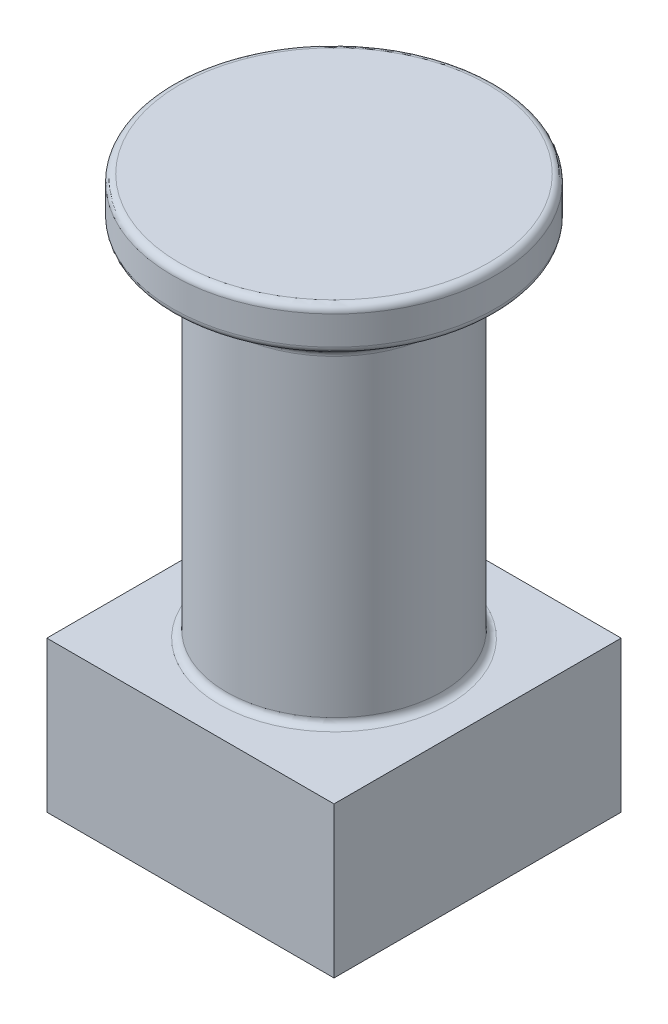
ISO-10303-21;
HEADER;
FILE_DESCRIPTION(('STEP AP214'),'2;1');
FILE_NAME('part.step','',(''),(''),'','','');
FILE_SCHEMA(('AUTOMOTIVE_DESIGN { 1 0 10303 214 1 1 1 1 }'));
ENDSEC;
DATA;
#1=APPLICATION_CONTEXT('core data for automotive mechanical design processes');
#2=APPLICATION_PROTOCOL_DEFINITION('international standard','automotive_design',2000,#1);
#3=PRODUCT_CONTEXT('',#1,'mechanical');
#4=PRODUCT('Part','Part','',(#3));
#5=PRODUCT_RELATED_PRODUCT_CATEGORY('part','',(#4));
#6=PRODUCT_DEFINITION_FORMATION('','',#4);
#7=PRODUCT_DEFINITION_CONTEXT('part definition',#1,'design');
#8=PRODUCT_DEFINITION('design','',#6,#7);
#9=PRODUCT_DEFINITION_SHAPE('','',#8);
#10=(LENGTH_UNIT() NAMED_UNIT(*) SI_UNIT(.MILLI.,.METRE.));
#11=(NAMED_UNIT(*) PLANE_ANGLE_UNIT() SI_UNIT($,.RADIAN.));
#12=(NAMED_UNIT(*) SI_UNIT($,.STERADIAN.) SOLID_ANGLE_UNIT());
#13=UNCERTAINTY_MEASURE_WITH_UNIT(LENGTH_MEASURE(1.E-05),#10,'distance_accuracy_value','');
#14=(GEOMETRIC_REPRESENTATION_CONTEXT(3) GLOBAL_UNCERTAINTY_ASSIGNED_CONTEXT((#13)) GLOBAL_UNIT_ASSIGNED_CONTEXT((#10,
#11,#12)) REPRESENTATION_CONTEXT('',''));
#15=CARTESIAN_POINT('',(0.,0.,0.));
#16=DIRECTION('',(0.,0.,1.));
#17=DIRECTION('',(1.,0.,0.));
#18=AXIS2_PLACEMENT_3D('',#15,#16,#17);
#19=CARTESIAN_POINT('',(20.,21.,-20.));
#20=DIRECTION('',(-1.,0.,0.));
#21=DIRECTION('',(0.,0.,1.));
#22=AXIS2_PLACEMENT_3D('',#19,#20,#21);
#23=PLANE('',#22);
#24=DIRECTION('',(0.,0.,-1.));
#25=VECTOR('',#24,1.);
#26=CARTESIAN_POINT('',(20.,0.,-20.));
#27=LINE('',#26,#25);
#28=CARTESIAN_POINT('',(20.,0.,20.));
#29=VERTEX_POINT('',#28);
#30=CARTESIAN_POINT('',(20.,0.,-20.));
#31=VERTEX_POINT('',#30);
#32=EDGE_CURVE('E103',#29,#31,#27,.T.);
#33=ORIENTED_EDGE('',*,*,#32,.T.);
#34=DIRECTION('',(0.,-1.,0.));
#35=VECTOR('',#34,1.);
#36=CARTESIAN_POINT('',(20.,21.,-20.));
#37=LINE('',#36,#35);
#38=CARTESIAN_POINT('',(20.,21.,-20.));
#39=VERTEX_POINT('',#38);
#40=EDGE_CURVE('E94',#39,#31,#37,.T.);
#41=ORIENTED_EDGE('',*,*,#40,.F.);
#42=DIRECTION('',(0.,0.,-1.));
#43=VECTOR('',#42,1.);
#44=CARTESIAN_POINT('',(20.,21.,-20.));
#45=LINE('',#44,#43);
#46=CARTESIAN_POINT('',(20.,21.,20.));
#47=VERTEX_POINT('',#46);
#48=EDGE_CURVE('E88',#47,#39,#45,.T.);
#49=ORIENTED_EDGE('',*,*,#48,.F.);
#50=DIRECTION('',(0.,-1.,0.));
#51=VECTOR('',#50,1.);
#52=CARTESIAN_POINT('',(20.,21.,20.));
#53=LINE('',#52,#51);
#54=EDGE_CURVE('E99',#47,#29,#53,.T.);
#55=ORIENTED_EDGE('',*,*,#54,.T.);
#56=EDGE_LOOP('',(#33,#41,#49,#55));
#57=FACE_BOUND('',#56,.T.);
#58=ADVANCED_FACE('F35',(#57),#23,.F.);
#59=CARTESIAN_POINT('',(-20.,21.,-20.));
#60=DIRECTION('',(0.,0.,1.));
#61=DIRECTION('',(1.,0.,0.));
#62=AXIS2_PLACEMENT_3D('',#59,#60,#61);
#63=PLANE('',#62);
#64=DIRECTION('',(-1.,0.,0.));
#65=VECTOR('',#64,1.);
#66=CARTESIAN_POINT('',(-20.,0.,-20.));
#67=LINE('',#66,#65);
#68=CARTESIAN_POINT('',(-20.,0.,-20.));
#69=VERTEX_POINT('',#68);
#70=EDGE_CURVE('E93',#31,#69,#67,.T.);
#71=ORIENTED_EDGE('',*,*,#70,.T.);
#72=DIRECTION('',(0.,-1.,0.));
#73=VECTOR('',#72,1.);
#74=CARTESIAN_POINT('',(-20.,21.,-20.));
#75=LINE('',#74,#73);
#76=CARTESIAN_POINT('',(-20.,21.,-20.));
#77=VERTEX_POINT('',#76);
#78=EDGE_CURVE('E91',#77,#69,#75,.T.);
#79=ORIENTED_EDGE('',*,*,#78,.F.);
#80=DIRECTION('',(-1.,0.,0.));
#81=VECTOR('',#80,1.);
#82=CARTESIAN_POINT('',(-20.,21.,-20.));
#83=LINE('',#82,#81);
#84=EDGE_CURVE('E83',#39,#77,#83,.T.);
#85=ORIENTED_EDGE('',*,*,#84,.F.);
#86=ORIENTED_EDGE('',*,*,#40,.T.);
#87=EDGE_LOOP('',(#71,#79,#85,#86));
#88=FACE_BOUND('',#87,.T.);
#89=ADVANCED_FACE('F92',(#88),#63,.F.);
#90=CARTESIAN_POINT('',(-20.,21.,-20.));
#91=DIRECTION('',(1.,0.,0.));
#92=DIRECTION('',(0.,0.,-1.));
#93=AXIS2_PLACEMENT_3D('',#90,#91,#92);
#94=PLANE('',#93);
#95=DIRECTION('',(0.,0.,1.));
#96=VECTOR('',#95,1.);
#97=CARTESIAN_POINT('',(-20.,0.,-20.));
#98=LINE('',#97,#96);
#99=CARTESIAN_POINT('',(-20.,0.,20.));
#100=VERTEX_POINT('',#99);
#101=EDGE_CURVE('E69',#69,#100,#98,.T.);
#102=ORIENTED_EDGE('',*,*,#101,.T.);
#103=DIRECTION('',(0.,-1.,0.));
#104=VECTOR('',#103,1.);
#105=CARTESIAN_POINT('',(-20.,21.,20.));
#106=LINE('',#105,#104);
#107=CARTESIAN_POINT('',(-20.,21.,20.));
#108=VERTEX_POINT('',#107);
#109=EDGE_CURVE('E95',#108,#100,#106,.T.);
#110=ORIENTED_EDGE('',*,*,#109,.F.);
#111=DIRECTION('',(0.,0.,1.));
#112=VECTOR('',#111,1.);
#113=CARTESIAN_POINT('',(-20.,21.,-20.));
#114=LINE('',#113,#112);
#115=EDGE_CURVE('E86',#77,#108,#114,.T.);
#116=ORIENTED_EDGE('',*,*,#115,.F.);
#117=ORIENTED_EDGE('',*,*,#78,.T.);
#118=EDGE_LOOP('',(#102,#110,#116,#117));
#119=FACE_BOUND('',#118,.T.);
#120=ADVANCED_FACE('F97',(#119),#94,.F.);
#121=CARTESIAN_POINT('',(-20.,21.,20.));
#122=DIRECTION('',(0.,0.,-1.));
#123=DIRECTION('',(-1.,0.,0.));
#124=AXIS2_PLACEMENT_3D('',#121,#122,#123);
#125=PLANE('',#124);
#126=DIRECTION('',(1.,0.,0.));
#127=VECTOR('',#126,1.);
#128=CARTESIAN_POINT('',(-20.,0.,20.));
#129=LINE('',#128,#127);
#130=EDGE_CURVE('E75',#100,#29,#129,.T.);
#131=ORIENTED_EDGE('',*,*,#130,.T.);
#132=ORIENTED_EDGE('',*,*,#54,.F.);
#133=DIRECTION('',(1.,0.,0.));
#134=VECTOR('',#133,1.);
#135=CARTESIAN_POINT('',(-20.,21.,20.));
#136=LINE('',#135,#134);
#137=EDGE_CURVE('E52',#108,#47,#136,.T.);
#138=ORIENTED_EDGE('',*,*,#137,.F.);
#139=ORIENTED_EDGE('',*,*,#109,.T.);
#140=EDGE_LOOP('',(#131,#132,#138,#139));
#141=FACE_BOUND('',#140,.T.);
#142=ADVANCED_FACE('F198',(#141),#125,.F.);
#143=CARTESIAN_POINT('',(0.,21.,0.));
#144=DIRECTION('',(0.,1.,0.));
#145=DIRECTION('',(0.,0.,1.));
#146=AXIS2_PLACEMENT_3D('',#143,#144,#145);
#147=PLANE('',#146);
#148=CARTESIAN_POINT('',(0.,21.,0.));
#149=DIRECTION('',(0.,1.,0.));
#150=DIRECTION('',(0.,0.,1.));
#151=AXIS2_PLACEMENT_3D('',#148,#149,#150);
#152=CIRCLE('',#151,16.);
#153=CARTESIAN_POINT('',(0.,21.,16.));
#154=VERTEX_POINT('',#153);
#155=EDGE_CURVE('E11',#154,#154,#152,.F.);
#156=ORIENTED_EDGE('',*,*,#155,.T.);
#157=EDGE_LOOP('',(#156));
#158=FACE_BOUND('',#157,.T.);
#159=ORIENTED_EDGE('',*,*,#48,.T.);
#160=ORIENTED_EDGE('',*,*,#84,.T.);
#161=ORIENTED_EDGE('',*,*,#115,.T.);
#162=ORIENTED_EDGE('',*,*,#137,.T.);
#163=EDGE_LOOP('',(#159,#160,#161,#162));
#164=FACE_BOUND('',#163,.T.);
#165=ADVANCED_FACE('F84',(#158,#164),#147,.T.);
#166=CARTESIAN_POINT('',(0.,0.,0.));
#167=DIRECTION('',(0.,1.,0.));
#168=DIRECTION('',(0.,0.,1.));
#169=AXIS2_PLACEMENT_3D('',#166,#167,#168);
#170=PLANE('',#169);
#171=ORIENTED_EDGE('',*,*,#32,.F.);
#172=ORIENTED_EDGE('',*,*,#130,.F.);
#173=ORIENTED_EDGE('',*,*,#101,.F.);
#174=ORIENTED_EDGE('',*,*,#70,.F.);
#175=EDGE_LOOP('',(#171,#172,#173,#174));
#176=FACE_BOUND('',#175,.T.);
#177=ADVANCED_FACE('F195',(#176),#170,.F.);
#178=CARTESIAN_POINT('',(0.,71.,0.));
#179=DIRECTION('',(0.,-1.,0.));
#180=DIRECTION('',(0.,0.,-1.));
#181=AXIS2_PLACEMENT_3D('',#178,#179,#180);
#182=CYLINDRICAL_SURFACE('',#181,15.);
#183=CARTESIAN_POINT('',(0.,65.5857864376269,0.));
#184=DIRECTION('',(0.,-1.,0.));
#185=DIRECTION('',(0.,0.,-1.));
#186=AXIS2_PLACEMENT_3D('',#183,#184,#185);
#187=CIRCLE('',#186,15.);
#188=CARTESIAN_POINT('',(0.,65.5857864376269,-15.));
#189=VERTEX_POINT('',#188);
#190=EDGE_CURVE('E44',#189,#189,#187,.T.);
#191=ORIENTED_EDGE('',*,*,#190,.T.);
#192=EDGE_LOOP('',(#191));
#193=FACE_BOUND('',#192,.T.);
#194=CARTESIAN_POINT('',(0.,22.,0.));
#195=DIRECTION('',(0.,1.,0.));
#196=DIRECTION('',(0.,0.,1.));
#197=AXIS2_PLACEMENT_3D('',#194,#195,#196);
#198=CIRCLE('',#197,15.);
#199=CARTESIAN_POINT('',(0.,22.,15.));
#200=VERTEX_POINT('',#199);
#201=EDGE_CURVE('E133',#200,#200,#198,.T.);
#202=ORIENTED_EDGE('',*,*,#201,.T.);
#203=EDGE_LOOP('',(#202));
#204=FACE_BOUND('',#203,.T.);
#205=ADVANCED_FACE('F138',(#193,#204),#182,.T.);
#206=CARTESIAN_POINT('',(0.,77.,0.));
#207=DIRECTION('',(0.,-1.,0.));
#208=DIRECTION('',(0.,0.,-1.));
#209=AXIS2_PLACEMENT_3D('',#206,#207,#208);
#210=CYLINDRICAL_SURFACE('',#209,22.5);
#211=CARTESIAN_POINT('',(0.,72.,0.));
#212=DIRECTION('',(0.,1.,0.));
#213=DIRECTION('',(0.,0.,1.));
#214=AXIS2_PLACEMENT_3D('',#211,#212,#213);
#215=CIRCLE('',#214,22.5);
#216=CARTESIAN_POINT('',(0.,72.,22.5));
#217=VERTEX_POINT('',#216);
#218=EDGE_CURVE('E115',#217,#217,#215,.T.);
#219=ORIENTED_EDGE('',*,*,#218,.T.);
#220=EDGE_LOOP('',(#219));
#221=FACE_BOUND('',#220,.T.);
#222=CARTESIAN_POINT('',(0.,76.,0.));
#223=DIRECTION('',(0.,1.,0.));
#224=DIRECTION('',(0.,0.,1.));
#225=AXIS2_PLACEMENT_3D('',#222,#223,#224);
#226=CIRCLE('',#225,22.5);
#227=CARTESIAN_POINT('',(0.,76.,22.5));
#228=VERTEX_POINT('',#227);
#229=EDGE_CURVE('E112',#228,#228,#226,.F.);
#230=ORIENTED_EDGE('',*,*,#229,.T.);
#231=EDGE_LOOP('',(#230));
#232=FACE_BOUND('',#231,.T.);
#233=ADVANCED_FACE('F182',(#221,#232),#210,.T.);
#234=CARTESIAN_POINT('',(0.,77.,0.));
#235=DIRECTION('',(0.,1.,0.));
#236=DIRECTION('',(0.,0.,1.));
#237=AXIS2_PLACEMENT_3D('',#234,#235,#236);
#238=PLANE('',#237);
#239=CARTESIAN_POINT('',(0.,77.,0.));
#240=DIRECTION('',(0.,1.,0.));
#241=DIRECTION('',(0.,0.,1.));
#242=AXIS2_PLACEMENT_3D('',#239,#240,#241);
#243=CIRCLE('',#242,21.5);
#244=CARTESIAN_POINT('',(0.,77.,21.5));
#245=VERTEX_POINT('',#244);
#246=EDGE_CURVE('E124',#245,#245,#243,.T.);
#247=ORIENTED_EDGE('',*,*,#246,.T.);
#248=EDGE_LOOP('',(#247));
#249=FACE_BOUND('',#248,.T.);
#250=ADVANCED_FACE('F180',(#249),#238,.T.);
#251=CARTESIAN_POINT('',(0.,71.,0.));
#252=DIRECTION('',(0.,1.,0.));
#253=DIRECTION('',(0.,0.,1.));
#254=AXIS2_PLACEMENT_3D('',#251,#252,#253);
#255=PLANE('',#254);
#256=CARTESIAN_POINT('',(0.,71.,0.));
#257=DIRECTION('',(0.,1.,0.));
#258=DIRECTION('',(0.,0.,1.));
#259=AXIS2_PLACEMENT_3D('',#256,#257,#258);
#260=CIRCLE('',#259,21.5);
#261=CARTESIAN_POINT('',(0.,71.,21.5));
#262=VERTEX_POINT('',#261);
#263=EDGE_CURVE('E121',#262,#262,#260,.F.);
#264=ORIENTED_EDGE('',*,*,#263,.T.);
#265=EDGE_LOOP('',(#264));
#266=FACE_BOUND('',#265,.T.);
#267=CARTESIAN_POINT('',(0.,71.,0.));
#268=DIRECTION('',(0.,1.,0.));
#269=DIRECTION('',(0.,0.,1.));
#270=AXIS2_PLACEMENT_3D('',#267,#268,#269);
#271=CIRCLE('',#270,20.4142135623731);
#272=CARTESIAN_POINT('',(0.,71.,20.4142135623731));
#273=VERTEX_POINT('',#272);
#274=EDGE_CURVE('E118',#273,#273,#271,.T.);
#275=ORIENTED_EDGE('',*,*,#274,.T.);
#276=EDGE_LOOP('',(#275));
#277=FACE_BOUND('',#276,.T.);
#278=ADVANCED_FACE('F167',(#266,#277),#255,.F.);
#279=CARTESIAN_POINT('',(0.,71.,0.));
#280=DIRECTION('',(0.,1.,0.));
#281=DIRECTION('',(0.,0.,1.));
#282=AXIS2_PLACEMENT_3D('',#279,#280,#281);
#283=CONICAL_SURFACE('',#282,20.,0.785398163397453);
#284=CARTESIAN_POINT('',(0.,70.7071067811866,0.));
#285=DIRECTION('',(0.,1.,0.));
#286=DIRECTION('',(0.,0.,1.));
#287=AXIS2_PLACEMENT_3D('',#284,#285,#286);
#288=CIRCLE('',#287,19.7071067811866);
#289=CARTESIAN_POINT('',(0.,70.7071067811866,19.7071067811866));
#290=VERTEX_POINT('',#289);
#291=EDGE_CURVE('E130',#290,#290,#288,.F.);
#292=ORIENTED_EDGE('',*,*,#291,.T.);
#293=EDGE_LOOP('',(#292));
#294=FACE_BOUND('',#293,.T.);
#295=CARTESIAN_POINT('',(0.,66.2928932188135,0.));
#296=DIRECTION('',(0.,1.,0.));
#297=DIRECTION('',(0.,0.,1.));
#298=AXIS2_PLACEMENT_3D('',#295,#296,#297);
#299=CIRCLE('',#298,15.2928932188135);
#300=CARTESIAN_POINT('',(0.,66.2928932188135,15.2928932188135));
#301=VERTEX_POINT('',#300);
#302=EDGE_CURVE('E127',#301,#301,#299,.T.);
#303=ORIENTED_EDGE('',*,*,#302,.T.);
#304=EDGE_LOOP('',(#303));
#305=FACE_BOUND('',#304,.T.);
#306=ADVANCED_FACE('F163',(#294,#305),#283,.T.);
#307=CARTESIAN_POINT('',(0.,72.,0.));
#308=DIRECTION('',(0.,1.,0.));
#309=DIRECTION('',(0.,0.,1.));
#310=AXIS2_PLACEMENT_3D('',#307,#308,#309);
#311=TOROIDAL_SURFACE('',#310,21.5,1.);
#312=ORIENTED_EDGE('',*,*,#263,.F.);
#313=EDGE_LOOP('',(#312));
#314=FACE_BOUND('',#313,.T.);
#315=ORIENTED_EDGE('',*,*,#218,.F.);
#316=EDGE_LOOP('',(#315));
#317=FACE_BOUND('',#316,.T.);
#318=ADVANCED_FACE('F166',(#314,#317),#311,.T.);
#319=CARTESIAN_POINT('',(0.,76.,0.));
#320=DIRECTION('',(0.,1.,0.));
#321=DIRECTION('',(0.,0.,1.));
#322=AXIS2_PLACEMENT_3D('',#319,#320,#321);
#323=TOROIDAL_SURFACE('',#322,21.5,1.);
#324=ORIENTED_EDGE('',*,*,#229,.F.);
#325=EDGE_LOOP('',(#324));
#326=FACE_BOUND('',#325,.T.);
#327=ORIENTED_EDGE('',*,*,#246,.F.);
#328=EDGE_LOOP('',(#327));
#329=FACE_BOUND('',#328,.T.);
#330=ADVANCED_FACE('F150',(#326,#329),#323,.T.);
#331=CARTESIAN_POINT('',(0.,70.,0.));
#332=DIRECTION('',(0.,1.,0.));
#333=DIRECTION('',(0.,0.,1.));
#334=AXIS2_PLACEMENT_3D('',#331,#332,#333);
#335=TOROIDAL_SURFACE('',#334,20.4142135623731,1.);
#336=ORIENTED_EDGE('',*,*,#291,.F.);
#337=EDGE_LOOP('',(#336));
#338=FACE_BOUND('',#337,.T.);
#339=ORIENTED_EDGE('',*,*,#274,.F.);
#340=EDGE_LOOP('',(#339));
#341=FACE_BOUND('',#340,.T.);
#342=ADVANCED_FACE('F143',(#338,#341),#335,.F.);
#343=CARTESIAN_POINT('',(0.,65.5857864376269,0.));
#344=DIRECTION('',(0.,-1.,0.));
#345=DIRECTION('',(0.,0.,-1.));
#346=AXIS2_PLACEMENT_3D('',#343,#344,#345);
#347=TOROIDAL_SURFACE('',#346,16.,1.);
#348=ORIENTED_EDGE('',*,*,#302,.F.);
#349=EDGE_LOOP('',(#348));
#350=FACE_BOUND('',#349,.T.);
#351=ORIENTED_EDGE('',*,*,#190,.F.);
#352=EDGE_LOOP('',(#351));
#353=FACE_BOUND('',#352,.T.);
#354=ADVANCED_FACE('F141',(#350,#353),#347,.F.);
#355=CARTESIAN_POINT('',(0.,22.,0.));
#356=DIRECTION('',(0.,1.,0.));
#357=DIRECTION('',(0.,0.,1.));
#358=AXIS2_PLACEMENT_3D('',#355,#356,#357);
#359=TOROIDAL_SURFACE('',#358,16.,1.);
#360=ORIENTED_EDGE('',*,*,#155,.F.);
#361=EDGE_LOOP('',(#360));
#362=FACE_BOUND('',#361,.T.);
#363=ORIENTED_EDGE('',*,*,#201,.F.);
#364=EDGE_LOOP('',(#363));
#365=FACE_BOUND('',#364,.T.);
#366=ADVANCED_FACE('F37',(#362,#365),#359,.F.);
#367=CLOSED_SHELL('',(#58,#89,#120,#142,#165,#177,#205,#233,#250,#278,#306,#318,#330,#342,#354,#366));
#368=MANIFOLD_SOLID_BREP('B2',#367);
#369=ADVANCED_BREP_SHAPE_REPRESENTATION('',(#18,#368),#14);
#370=SHAPE_DEFINITION_REPRESENTATION(#9,#369);
ENDSEC;
END-ISO-10303-21;
